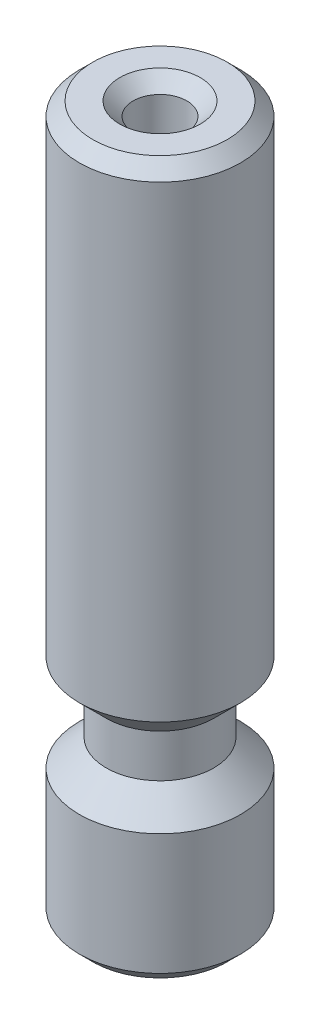
ISO-10303-21;
HEADER;
FILE_DESCRIPTION(('STEP AP214'),'2;1');
FILE_NAME('part.step','',(''),(''),'','','');
FILE_SCHEMA(('AUTOMOTIVE_DESIGN { 1 0 10303 214 1 1 1 1 }'));
ENDSEC;
DATA;
#1=APPLICATION_CONTEXT('core data for automotive mechanical design processes');
#2=APPLICATION_PROTOCOL_DEFINITION('international standard','automotive_design',2000,#1);
#3=PRODUCT_CONTEXT('',#1,'mechanical');
#4=PRODUCT('Part','Part','',(#3));
#5=PRODUCT_RELATED_PRODUCT_CATEGORY('part','',(#4));
#6=PRODUCT_DEFINITION_FORMATION('','',#4);
#7=PRODUCT_DEFINITION_CONTEXT('part definition',#1,'design');
#8=PRODUCT_DEFINITION('design','',#6,#7);
#9=PRODUCT_DEFINITION_SHAPE('','',#8);
#10=(LENGTH_UNIT() NAMED_UNIT(*) SI_UNIT(.MILLI.,.METRE.));
#11=(NAMED_UNIT(*) PLANE_ANGLE_UNIT() SI_UNIT($,.RADIAN.));
#12=(NAMED_UNIT(*) SI_UNIT($,.STERADIAN.) SOLID_ANGLE_UNIT());
#13=UNCERTAINTY_MEASURE_WITH_UNIT(LENGTH_MEASURE(1.E-05),#10,'distance_accuracy_value','');
#14=(GEOMETRIC_REPRESENTATION_CONTEXT(3) GLOBAL_UNCERTAINTY_ASSIGNED_CONTEXT((#13)) GLOBAL_UNIT_ASSIGNED_CONTEXT((#10,
#11,#12)) REPRESENTATION_CONTEXT('',''));
#15=CARTESIAN_POINT('',(0.,0.,0.));
#16=DIRECTION('',(0.,0.,1.));
#17=DIRECTION('',(1.,0.,0.));
#18=AXIS2_PLACEMENT_3D('',#15,#16,#17);
#19=CARTESIAN_POINT('',(-3.,0.,0.));
#20=DIRECTION('',(0.,1.,0.));
#21=DIRECTION('',(-1.,0.,0.));
#22=AXIS2_PLACEMENT_3D('',#19,#20,#21);
#23=PLANE('',#22);
#24=CARTESIAN_POINT('',(0.,0.,0.));
#25=DIRECTION('',(0.,1.,0.));
#26=DIRECTION('',(-1.,0.,0.));
#27=AXIS2_PLACEMENT_3D('',#24,#25,#26);
#28=CIRCLE('',#27,2.49999999999996);
#29=CARTESIAN_POINT('',(-2.49999999999996,0.,0.));
#30=VERTEX_POINT('',#29);
#31=EDGE_CURVE('E53',#30,#30,#28,.F.);
#32=ORIENTED_EDGE('',*,*,#31,.T.);
#33=EDGE_LOOP('',(#32));
#34=FACE_BOUND('',#33,.T.);
#35=CARTESIAN_POINT('',(0.,0.,0.));
#36=DIRECTION('',(0.,-1.,0.));
#37=DIRECTION('',(1.,0.,0.));
#38=AXIS2_PLACEMENT_3D('',#35,#36,#37);
#39=CIRCLE('',#38,1.);
#40=CARTESIAN_POINT('',(1.,0.,0.));
#41=VERTEX_POINT('',#40);
#42=EDGE_CURVE('E56',#41,#41,#39,.T.);
#43=ORIENTED_EDGE('',*,*,#42,.F.);
#44=EDGE_LOOP('',(#43));
#45=FACE_BOUND('',#44,.T.);
#46=ADVANCED_FACE('F30',(#34,#45),#23,.F.);
#47=CARTESIAN_POINT('',(3.49148133884313E-12,-1000.,0.));
#48=DIRECTION('',(0.,-1.,0.));
#49=DIRECTION('',(1.,0.,0.));
#50=AXIS2_PLACEMENT_3D('',#47,#48,#49);
#51=CYLINDRICAL_SURFACE('',#50,0.999999999961);
#52=CARTESIAN_POINT('',(0.,26.0000000000389,0.));
#53=DIRECTION('',(0.,-1.,0.));
#54=DIRECTION('',(1.,0.,0.));
#55=AXIS2_PLACEMENT_3D('',#52,#53,#54);
#56=CIRCLE('',#55,0.999999999961);
#57=CARTESIAN_POINT('',(0.999999999960909,26.0000000000389,0.));
#58=VERTEX_POINT('',#57);
#59=EDGE_CURVE('E10',#58,#58,#56,.F.);
#60=ORIENTED_EDGE('',*,*,#59,.T.);
#61=EDGE_LOOP('',(#60));
#62=FACE_BOUND('',#61,.T.);
#63=ORIENTED_EDGE('',*,*,#42,.T.);
#64=EDGE_LOOP('',(#63));
#65=FACE_BOUND('',#64,.T.);
#66=ADVANCED_FACE('F100',(#62,#65),#51,.F.);
#67=CARTESIAN_POINT('',(-0.999999999922091,26.5,0.));
#68=DIRECTION('',(0.,-1.,0.));
#69=DIRECTION('',(1.,0.,0.));
#70=AXIS2_PLACEMENT_3D('',#67,#68,#69);
#71=PLANE('',#70);
#72=CARTESIAN_POINT('',(0.,26.5,0.));
#73=DIRECTION('',(0.,-1.,0.));
#74=DIRECTION('',(1.,0.,0.));
#75=AXIS2_PLACEMENT_3D('',#72,#73,#74);
#76=CIRCLE('',#75,2.49999999992367);
#77=CARTESIAN_POINT('',(2.49999999992358,26.5,0.));
#78=VERTEX_POINT('',#77);
#79=EDGE_CURVE('E37',#78,#78,#76,.F.);
#80=ORIENTED_EDGE('',*,*,#79,.T.);
#81=EDGE_LOOP('',(#80));
#82=FACE_BOUND('',#81,.T.);
#83=CARTESIAN_POINT('',(0.,26.5,0.));
#84=DIRECTION('',(0.,-1.,0.));
#85=DIRECTION('',(1.,0.,0.));
#86=AXIS2_PLACEMENT_3D('',#83,#84,#85);
#87=CIRCLE('',#86,1.4999999999221);
#88=CARTESIAN_POINT('',(1.499999999922,26.5,0.));
#89=VERTEX_POINT('',#88);
#90=EDGE_CURVE('E41',#89,#89,#87,.T.);
#91=ORIENTED_EDGE('',*,*,#90,.T.);
#92=EDGE_LOOP('',(#91));
#93=FACE_BOUND('',#92,.T.);
#94=ADVANCED_FACE('F94',(#82,#93),#71,.F.);
#95=CARTESIAN_POINT('',(3.49148133884313E-12,-1000.,0.));
#96=DIRECTION('',(0.,-1.,0.));
#97=DIRECTION('',(1.,0.,0.));
#98=AXIS2_PLACEMENT_3D('',#95,#96,#97);
#99=CYLINDRICAL_SURFACE('',#98,2.99999999992388);
#100=CARTESIAN_POINT('',(0.,25.9999999999998,0.));
#101=DIRECTION('',(0.,-1.,0.));
#102=DIRECTION('',(1.,0.,0.));
#103=AXIS2_PLACEMENT_3D('',#100,#101,#102);
#104=CIRCLE('',#103,2.99999999992388);
#105=CARTESIAN_POINT('',(2.99999999992379,25.9999999999998,0.));
#106=VERTEX_POINT('',#105);
#107=EDGE_CURVE('E45',#106,#106,#104,.T.);
#108=ORIENTED_EDGE('',*,*,#107,.T.);
#109=EDGE_LOOP('',(#108));
#110=FACE_BOUND('',#109,.T.);
#111=CARTESIAN_POINT('',(0.,8.59999999999994,0.));
#112=DIRECTION('',(0.,-1.,0.));
#113=DIRECTION('',(1.,0.,0.));
#114=AXIS2_PLACEMENT_3D('',#111,#112,#113);
#115=CIRCLE('',#114,2.99999999992391);
#116=CARTESIAN_POINT('',(2.99999999992388,8.59999999999995,0.));
#117=VERTEX_POINT('',#116);
#118=EDGE_CURVE('E59',#117,#117,#115,.T.);
#119=ORIENTED_EDGE('',*,*,#118,.F.);
#120=EDGE_LOOP('',(#119));
#121=FACE_BOUND('',#120,.T.);
#122=ADVANCED_FACE('F89',(#110,#121),#99,.T.);
#123=CARTESIAN_POINT('',(0.,8.59999999999994,0.));
#124=DIRECTION('',(0.,1.,0.));
#125=DIRECTION('',(-1.,0.,0.));
#126=AXIS2_PLACEMENT_3D('',#123,#124,#125);
#127=CONICAL_SURFACE('',#126,2.99999999992391,0.785398163397426);
#128=CARTESIAN_POINT('',(0.,7.59999999999805,0.));
#129=DIRECTION('',(0.,-1.,0.));
#130=DIRECTION('',(1.,0.,0.));
#131=AXIS2_PLACEMENT_3D('',#128,#129,#130);
#132=CIRCLE('',#131,1.99999999992207);
#133=CARTESIAN_POINT('',(1.99999999992204,7.59999999999806,0.));
#134=VERTEX_POINT('',#133);
#135=EDGE_CURVE('E62',#134,#134,#132,.T.);
#136=ORIENTED_EDGE('',*,*,#135,.F.);
#137=EDGE_LOOP('',(#136));
#138=FACE_BOUND('',#137,.T.);
#139=ORIENTED_EDGE('',*,*,#118,.T.);
#140=EDGE_LOOP('',(#139));
#141=FACE_BOUND('',#140,.T.);
#142=ADVANCED_FACE('F83',(#138,#141),#127,.T.);
#143=CARTESIAN_POINT('',(3.49148133884313E-12,-1000.,0.));
#144=DIRECTION('',(0.,-1.,0.));
#145=DIRECTION('',(1.,0.,0.));
#146=AXIS2_PLACEMENT_3D('',#143,#144,#145);
#147=CYLINDRICAL_SURFACE('',#146,1.99999999996102);
#148=CARTESIAN_POINT('',(0.,6.00000000000001,0.));
#149=DIRECTION('',(0.,-1.,0.));
#150=DIRECTION('',(1.,0.,0.));
#151=AXIS2_PLACEMENT_3D('',#148,#149,#150);
#152=CIRCLE('',#151,1.99999999999998);
#153=CARTESIAN_POINT('',(1.99999999999996,6.00000000000001,0.));
#154=VERTEX_POINT('',#153);
#155=EDGE_CURVE('E65',#154,#154,#152,.T.);
#156=ORIENTED_EDGE('',*,*,#155,.F.);
#157=EDGE_LOOP('',(#156));
#158=FACE_BOUND('',#157,.T.);
#159=ORIENTED_EDGE('',*,*,#135,.T.);
#160=EDGE_LOOP('',(#159));
#161=FACE_BOUND('',#160,.T.);
#162=ADVANCED_FACE('F77',(#158,#161),#147,.T.);
#163=CARTESIAN_POINT('',(0.,6.00000000000001,0.));
#164=DIRECTION('',(0.,-1.,0.));
#165=DIRECTION('',(1.,0.,0.));
#166=AXIS2_PLACEMENT_3D('',#163,#164,#165);
#167=CONICAL_SURFACE('',#166,1.99999999999998,0.785398163397393);
#168=CARTESIAN_POINT('',(0.,4.99999999999989,0.));
#169=DIRECTION('',(0.,-1.,0.));
#170=DIRECTION('',(1.,0.,0.));
#171=AXIS2_PLACEMENT_3D('',#168,#169,#170);
#172=CIRCLE('',#171,2.99999999999998);
#173=CARTESIAN_POINT('',(2.99999999999997,4.9999999999999,0.));
#174=VERTEX_POINT('',#173);
#175=EDGE_CURVE('E68',#174,#174,#172,.T.);
#176=ORIENTED_EDGE('',*,*,#175,.F.);
#177=EDGE_LOOP('',(#176));
#178=FACE_BOUND('',#177,.T.);
#179=ORIENTED_EDGE('',*,*,#155,.T.);
#180=EDGE_LOOP('',(#179));
#181=FACE_BOUND('',#180,.T.);
#182=ADVANCED_FACE('F74',(#178,#181),#167,.T.);
#183=CARTESIAN_POINT('',(3.49148133884313E-12,-1000.,0.));
#184=DIRECTION('',(0.,-1.,0.));
#185=DIRECTION('',(1.,0.,0.));
#186=AXIS2_PLACEMENT_3D('',#183,#184,#185);
#187=CYLINDRICAL_SURFACE('',#186,2.99999999999999);
#188=CARTESIAN_POINT('',(0.,0.499999999999945,0.));
#189=DIRECTION('',(0.,1.,0.));
#190=DIRECTION('',(-1.,0.,0.));
#191=AXIS2_PLACEMENT_3D('',#188,#189,#190);
#192=CIRCLE('',#191,2.99999999999999);
#193=CARTESIAN_POINT('',(-2.99999999999999,0.499999999999934,0.));
#194=VERTEX_POINT('',#193);
#195=EDGE_CURVE('E50',#194,#194,#192,.T.);
#196=ORIENTED_EDGE('',*,*,#195,.T.);
#197=EDGE_LOOP('',(#196));
#198=FACE_BOUND('',#197,.T.);
#199=ORIENTED_EDGE('',*,*,#175,.T.);
#200=EDGE_LOOP('',(#199));
#201=FACE_BOUND('',#200,.T.);
#202=ADVANCED_FACE('F72',(#198,#201),#187,.T.);
#203=CARTESIAN_POINT('',(0.,0.,0.));
#204=DIRECTION('',(0.,1.,0.));
#205=DIRECTION('',(-1.,0.,0.));
#206=AXIS2_PLACEMENT_3D('',#203,#204,#205);
#207=CONICAL_SURFACE('',#206,2.49999999999996,0.785398163397539);
#208=ORIENTED_EDGE('',*,*,#195,.F.);
#209=EDGE_LOOP('',(#208));
#210=FACE_BOUND('',#209,.T.);
#211=ORIENTED_EDGE('',*,*,#31,.F.);
#212=EDGE_LOOP('',(#211));
#213=FACE_BOUND('',#212,.T.);
#214=ADVANCED_FACE('F111',(#210,#213),#207,.T.);
#215=CARTESIAN_POINT('',(0.,25.9999999999998,0.));
#216=DIRECTION('',(0.,-1.,0.));
#217=DIRECTION('',(1.,0.,0.));
#218=AXIS2_PLACEMENT_3D('',#215,#216,#217);
#219=CONICAL_SURFACE('',#218,2.99999999992388,0.785398163397453);
#220=ORIENTED_EDGE('',*,*,#79,.F.);
#221=EDGE_LOOP('',(#220));
#222=FACE_BOUND('',#221,.T.);
#223=ORIENTED_EDGE('',*,*,#107,.F.);
#224=EDGE_LOOP('',(#223));
#225=FACE_BOUND('',#224,.T.);
#226=ADVANCED_FACE('F113',(#222,#225),#219,.T.);
#227=CARTESIAN_POINT('',(0.,26.5,0.));
#228=DIRECTION('',(0.,1.,0.));
#229=DIRECTION('',(-1.,0.,0.));
#230=AXIS2_PLACEMENT_3D('',#227,#228,#229);
#231=CONICAL_SURFACE('',#230,1.49999999992206,0.78539816339742);
#232=ORIENTED_EDGE('',*,*,#59,.F.);
#233=EDGE_LOOP('',(#232));
#234=FACE_BOUND('',#233,.T.);
#235=ORIENTED_EDGE('',*,*,#90,.F.);
#236=EDGE_LOOP('',(#235));
#237=FACE_BOUND('',#236,.T.);
#238=ADVANCED_FACE('F32',(#234,#237),#231,.F.);
#239=CLOSED_SHELL('',(#46,#66,#94,#122,#142,#162,#182,#202,#214,#226,#238));
#240=MANIFOLD_SOLID_BREP('B2',#239);
#241=ADVANCED_BREP_SHAPE_REPRESENTATION('',(#18,#240),#14);
#242=SHAPE_DEFINITION_REPRESENTATION(#9,#241);
ENDSEC;
END-ISO-10303-21;
